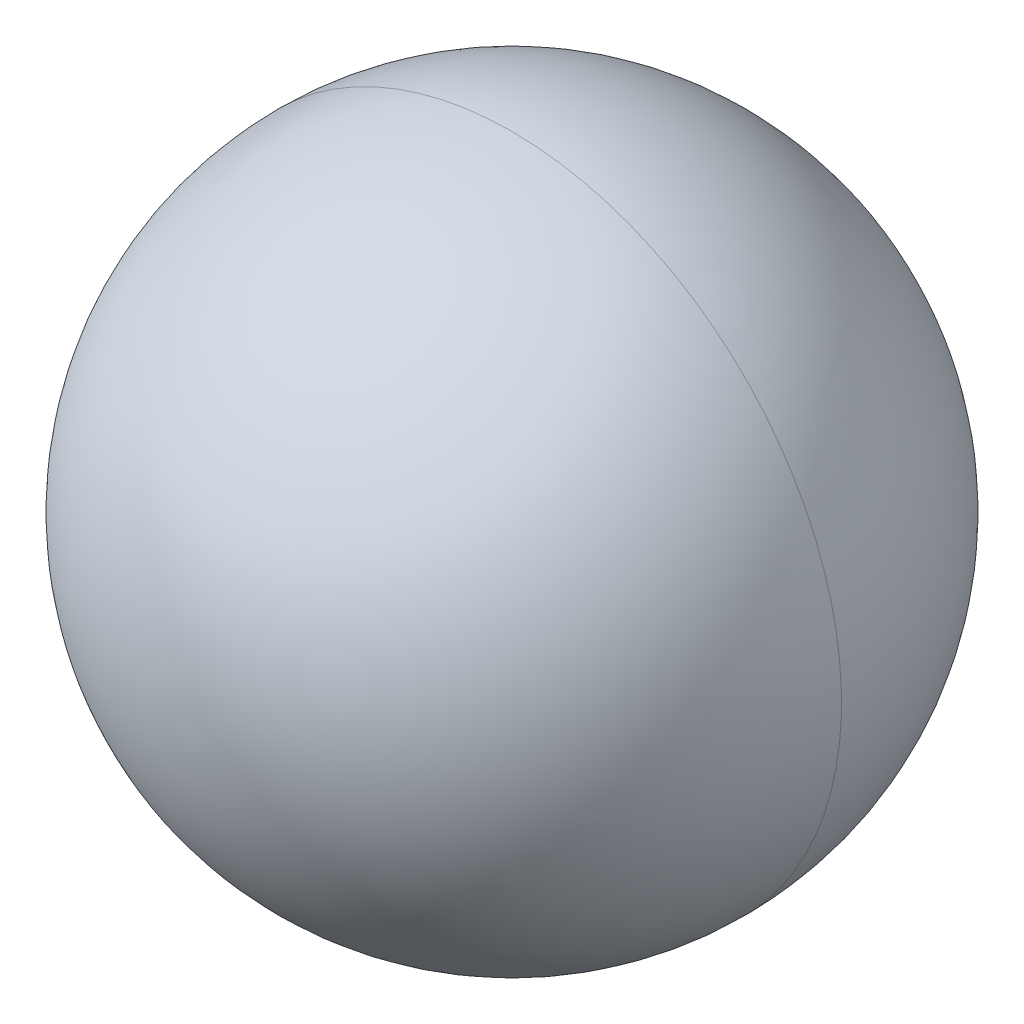
ISO-10303-21;
HEADER;
FILE_DESCRIPTION(('STEP AP214'),'2;1');
FILE_NAME('part.step','',(''),(''),'','','');
FILE_SCHEMA(('AUTOMOTIVE_DESIGN { 1 0 10303 214 1 1 1 1 }'));
ENDSEC;
DATA;
#1=APPLICATION_CONTEXT('core data for automotive mechanical design processes');
#2=APPLICATION_PROTOCOL_DEFINITION('international standard','automotive_design',2000,#1);
#3=PRODUCT_CONTEXT('',#1,'mechanical');
#4=PRODUCT('Part','Part','',(#3));
#5=PRODUCT_RELATED_PRODUCT_CATEGORY('part','',(#4));
#6=PRODUCT_DEFINITION_FORMATION('','',#4);
#7=PRODUCT_DEFINITION_CONTEXT('part definition',#1,'design');
#8=PRODUCT_DEFINITION('design','',#6,#7);
#9=PRODUCT_DEFINITION_SHAPE('','',#8);
#10=(LENGTH_UNIT() NAMED_UNIT(*) SI_UNIT(.MILLI.,.METRE.));
#11=(NAMED_UNIT(*) PLANE_ANGLE_UNIT() SI_UNIT($,.RADIAN.));
#12=(NAMED_UNIT(*) SI_UNIT($,.STERADIAN.) SOLID_ANGLE_UNIT());
#13=UNCERTAINTY_MEASURE_WITH_UNIT(LENGTH_MEASURE(1.E-05),#10,'distance_accuracy_value','');
#14=(GEOMETRIC_REPRESENTATION_CONTEXT(3) GLOBAL_UNCERTAINTY_ASSIGNED_CONTEXT((#13)) GLOBAL_UNIT_ASSIGNED_CONTEXT((#10,
#11,#12)) REPRESENTATION_CONTEXT('',''));
#15=CARTESIAN_POINT('',(0.,0.,0.));
#16=DIRECTION('',(0.,0.,1.));
#17=DIRECTION('',(1.,0.,0.));
#18=AXIS2_PLACEMENT_3D('',#15,#16,#17);
#19=CARTESIAN_POINT('',(0.,0.,0.));
#20=DIRECTION('',(0.,0.,1.));
#21=DIRECTION('',(-1.,0.,0.));
#22=AXIS2_PLACEMENT_3D('',#19,#20,#21);
#23=SPHERICAL_SURFACE('',#22,7.);
#24=CARTESIAN_POINT('',(0.,0.,0.));
#25=DIRECTION('',(0.,0.,1.));
#26=DIRECTION('',(1.,0.,0.));
#27=AXIS2_PLACEMENT_3D('',#24,#25,#26);
#28=CIRCLE('',#27,7.);
#29=CARTESIAN_POINT('',(0.,-7.,0.));
#30=VERTEX_POINT('',#29);
#31=CARTESIAN_POINT('',(0.,7.,0.));
#32=VERTEX_POINT('',#31);
#33=EDGE_CURVE('E11',#30,#32,#28,.T.);
#34=ORIENTED_EDGE('',*,*,#33,.F.);
#35=CARTESIAN_POINT('',(0.,0.,0.));
#36=DIRECTION('',(0.,0.,-1.));
#37=DIRECTION('',(-1.,0.,0.));
#38=AXIS2_PLACEMENT_3D('',#35,#36,#37);
#39=CIRCLE('',#38,7.);
#40=EDGE_CURVE('E24',#30,#32,#39,.T.);
#41=ORIENTED_EDGE('',*,*,#40,.T.);
#42=EDGE_LOOP('',(#34,#41));
#43=FACE_BOUND('',#42,.T.);
#44=ADVANCED_FACE('F16',(#43),#23,.T.);
#45=CARTESIAN_POINT('',(0.,0.,0.));
#46=DIRECTION('',(0.,0.,1.));
#47=DIRECTION('',(-1.,0.,0.));
#48=AXIS2_PLACEMENT_3D('',#45,#46,#47);
#49=SPHERICAL_SURFACE('',#48,7.);
#50=ORIENTED_EDGE('',*,*,#40,.F.);
#51=ORIENTED_EDGE('',*,*,#33,.T.);
#52=EDGE_LOOP('',(#50,#51));
#53=FACE_BOUND('',#52,.T.);
#54=ADVANCED_FACE('F40',(#53),#49,.T.);
#55=CLOSED_SHELL('',(#44,#54));
#56=MANIFOLD_SOLID_BREP('B1',#55);
#57=ADVANCED_BREP_SHAPE_REPRESENTATION('',(#18,#56),#14);
#58=SHAPE_DEFINITION_REPRESENTATION(#9,#57);
ENDSEC;
END-ISO-10303-21;
